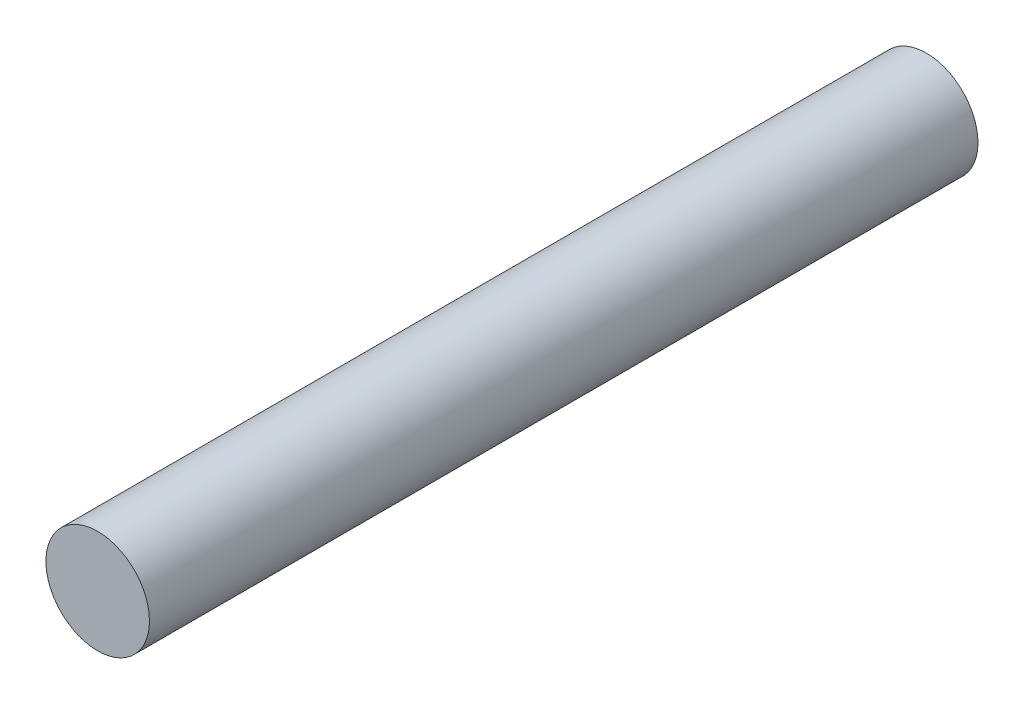
ISO-10303-21;
HEADER;
FILE_DESCRIPTION(('STEP AP214'),'2;1');
FILE_NAME('part.step','',(''),(''),'','','');
FILE_SCHEMA(('AUTOMOTIVE_DESIGN { 1 0 10303 214 1 1 1 1 }'));
ENDSEC;
DATA;
#1=APPLICATION_CONTEXT('core data for automotive mechanical design processes');
#2=APPLICATION_PROTOCOL_DEFINITION('international standard','automotive_design',2000,#1);
#3=PRODUCT_CONTEXT('',#1,'mechanical');
#4=PRODUCT('Part','Part','',(#3));
#5=PRODUCT_RELATED_PRODUCT_CATEGORY('part','',(#4));
#6=PRODUCT_DEFINITION_FORMATION('','',#4);
#7=PRODUCT_DEFINITION_CONTEXT('part definition',#1,'design');
#8=PRODUCT_DEFINITION('design','',#6,#7);
#9=PRODUCT_DEFINITION_SHAPE('','',#8);
#10=(LENGTH_UNIT() NAMED_UNIT(*) SI_UNIT(.MILLI.,.METRE.));
#11=(NAMED_UNIT(*) PLANE_ANGLE_UNIT() SI_UNIT($,.RADIAN.));
#12=(NAMED_UNIT(*) SI_UNIT($,.STERADIAN.) SOLID_ANGLE_UNIT());
#13=UNCERTAINTY_MEASURE_WITH_UNIT(LENGTH_MEASURE(1.E-05),#10,'distance_accuracy_value','');
#14=(GEOMETRIC_REPRESENTATION_CONTEXT(3) GLOBAL_UNCERTAINTY_ASSIGNED_CONTEXT((#13)) GLOBAL_UNIT_ASSIGNED_CONTEXT((#10,
#11,#12)) REPRESENTATION_CONTEXT('',''));
#15=CARTESIAN_POINT('',(0.,0.,0.));
#16=DIRECTION('',(0.,0.,1.));
#17=DIRECTION('',(1.,0.,0.));
#18=AXIS2_PLACEMENT_3D('',#15,#16,#17);
#19=CARTESIAN_POINT('',(0.,0.,64.));
#20=DIRECTION('',(0.,0.,-1.));
#21=DIRECTION('',(-1.,0.,0.));
#22=AXIS2_PLACEMENT_3D('',#19,#20,#21);
#23=CYLINDRICAL_SURFACE('',#22,4.);
#24=CARTESIAN_POINT('',(0.,0.,64.));
#25=DIRECTION('',(0.,0.,1.));
#26=DIRECTION('',(1.,0.,0.));
#27=AXIS2_PLACEMENT_3D('',#24,#25,#26);
#28=CIRCLE('',#27,4.);
#29=CARTESIAN_POINT('',(4.,0.,64.));
#30=VERTEX_POINT('',#29);
#31=EDGE_CURVE('E10',#30,#30,#28,.T.);
#32=ORIENTED_EDGE('',*,*,#31,.F.);
#33=EDGE_LOOP('',(#32));
#34=FACE_BOUND('',#33,.T.);
#35=CARTESIAN_POINT('',(0.,0.,0.));
#36=DIRECTION('',(0.,0.,1.));
#37=DIRECTION('',(1.,0.,0.));
#38=AXIS2_PLACEMENT_3D('',#35,#36,#37);
#39=CIRCLE('',#38,4.);
#40=CARTESIAN_POINT('',(4.,0.,0.));
#41=VERTEX_POINT('',#40);
#42=EDGE_CURVE('E33',#41,#41,#39,.T.);
#43=ORIENTED_EDGE('',*,*,#42,.T.);
#44=EDGE_LOOP('',(#43));
#45=FACE_BOUND('',#44,.T.);
#46=ADVANCED_FACE('F30',(#34,#45),#23,.T.);
#47=CARTESIAN_POINT('',(0.,0.,64.));
#48=DIRECTION('',(0.,0.,1.));
#49=DIRECTION('',(1.,0.,0.));
#50=AXIS2_PLACEMENT_3D('',#47,#48,#49);
#51=PLANE('',#50);
#52=ORIENTED_EDGE('',*,*,#31,.T.);
#53=EDGE_LOOP('',(#52));
#54=FACE_BOUND('',#53,.T.);
#55=ADVANCED_FACE('F45',(#54),#51,.T.);
#56=CARTESIAN_POINT('',(0.,0.,0.));
#57=DIRECTION('',(0.,0.,1.));
#58=DIRECTION('',(1.,0.,0.));
#59=AXIS2_PLACEMENT_3D('',#56,#57,#58);
#60=PLANE('',#59);
#61=ORIENTED_EDGE('',*,*,#42,.F.);
#62=EDGE_LOOP('',(#61));
#63=FACE_BOUND('',#62,.T.);
#64=ADVANCED_FACE('F43',(#63),#60,.F.);
#65=CLOSED_SHELL('',(#46,#55,#64));
#66=MANIFOLD_SOLID_BREP('B2',#65);
#67=ADVANCED_BREP_SHAPE_REPRESENTATION('',(#18,#66),#14);
#68=SHAPE_DEFINITION_REPRESENTATION(#9,#67);
ENDSEC;
END-ISO-10303-21;
